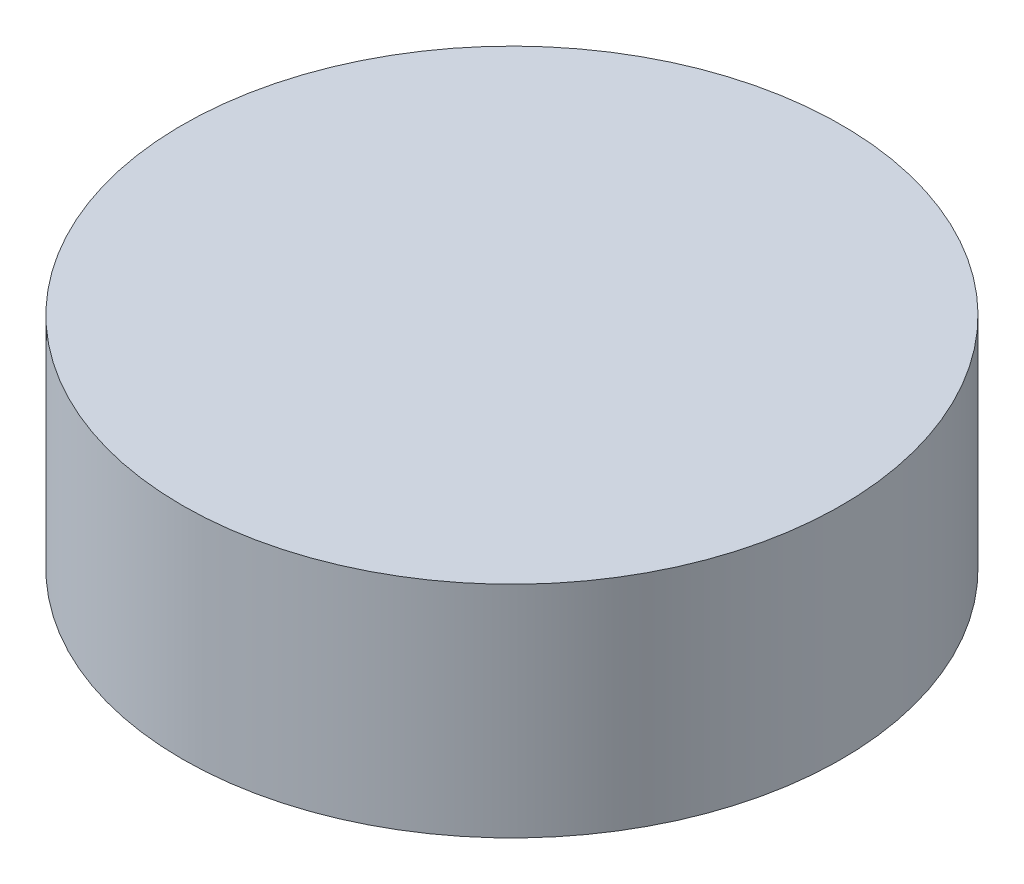
ISO-10303-21;
HEADER;
FILE_DESCRIPTION(('STEP AP214'),'2;1');
FILE_NAME('part.step','',(''),(''),'','','');
FILE_SCHEMA(('AUTOMOTIVE_DESIGN { 1 0 10303 214 1 1 1 1 }'));
ENDSEC;
DATA;
#1=APPLICATION_CONTEXT('core data for automotive mechanical design processes');
#2=APPLICATION_PROTOCOL_DEFINITION('international standard','automotive_design',2000,#1);
#3=PRODUCT_CONTEXT('',#1,'mechanical');
#4=PRODUCT('Part','Part','',(#3));
#5=PRODUCT_RELATED_PRODUCT_CATEGORY('part','',(#4));
#6=PRODUCT_DEFINITION_FORMATION('','',#4);
#7=PRODUCT_DEFINITION_CONTEXT('part definition',#1,'design');
#8=PRODUCT_DEFINITION('design','',#6,#7);
#9=PRODUCT_DEFINITION_SHAPE('','',#8);
#10=(LENGTH_UNIT() NAMED_UNIT(*) SI_UNIT(.MILLI.,.METRE.));
#11=(NAMED_UNIT(*) PLANE_ANGLE_UNIT() SI_UNIT($,.RADIAN.));
#12=(NAMED_UNIT(*) SI_UNIT($,.STERADIAN.) SOLID_ANGLE_UNIT());
#13=UNCERTAINTY_MEASURE_WITH_UNIT(LENGTH_MEASURE(1.E-05),#10,'distance_accuracy_value','');
#14=(GEOMETRIC_REPRESENTATION_CONTEXT(3) GLOBAL_UNCERTAINTY_ASSIGNED_CONTEXT((#13)) GLOBAL_UNIT_ASSIGNED_CONTEXT((#10,
#11,#12)) REPRESENTATION_CONTEXT('',''));
#15=CARTESIAN_POINT('',(0.,0.,0.));
#16=DIRECTION('',(0.,0.,1.));
#17=DIRECTION('',(1.,0.,0.));
#18=AXIS2_PLACEMENT_3D('',#15,#16,#17);
#19=CARTESIAN_POINT('',(0.,1.,0.));
#20=DIRECTION('',(0.,-1.,0.));
#21=DIRECTION('',(0.,0.,-1.));
#22=AXIS2_PLACEMENT_3D('',#19,#20,#21);
#23=CYLINDRICAL_SURFACE('',#22,1.5);
#24=CARTESIAN_POINT('',(0.,1.,0.));
#25=DIRECTION('',(0.,1.,0.));
#26=DIRECTION('',(0.,0.,1.));
#27=AXIS2_PLACEMENT_3D('',#24,#25,#26);
#28=CIRCLE('',#27,1.5);
#29=CARTESIAN_POINT('',(0.,1.,1.5));
#30=VERTEX_POINT('',#29);
#31=EDGE_CURVE('E10',#30,#30,#28,.T.);
#32=ORIENTED_EDGE('',*,*,#31,.F.);
#33=EDGE_LOOP('',(#32));
#34=FACE_BOUND('',#33,.T.);
#35=CARTESIAN_POINT('',(0.,0.,0.));
#36=DIRECTION('',(0.,1.,0.));
#37=DIRECTION('',(0.,0.,1.));
#38=AXIS2_PLACEMENT_3D('',#35,#36,#37);
#39=CIRCLE('',#38,1.5);
#40=CARTESIAN_POINT('',(0.,0.,1.5));
#41=VERTEX_POINT('',#40);
#42=EDGE_CURVE('E35',#41,#41,#39,.T.);
#43=ORIENTED_EDGE('',*,*,#42,.T.);
#44=EDGE_LOOP('',(#43));
#45=FACE_BOUND('',#44,.T.);
#46=ADVANCED_FACE('F32',(#34,#45),#23,.T.);
#47=CARTESIAN_POINT('',(0.,1.,0.));
#48=DIRECTION('',(0.,1.,0.));
#49=DIRECTION('',(0.,0.,1.));
#50=AXIS2_PLACEMENT_3D('',#47,#48,#49);
#51=PLANE('',#50);
#52=ORIENTED_EDGE('',*,*,#31,.T.);
#53=EDGE_LOOP('',(#52));
#54=FACE_BOUND('',#53,.T.);
#55=ADVANCED_FACE('F47',(#54),#51,.T.);
#56=CARTESIAN_POINT('',(0.,0.,0.));
#57=DIRECTION('',(0.,1.,0.));
#58=DIRECTION('',(0.,0.,1.));
#59=AXIS2_PLACEMENT_3D('',#56,#57,#58);
#60=PLANE('',#59);
#61=ORIENTED_EDGE('',*,*,#42,.F.);
#62=EDGE_LOOP('',(#61));
#63=FACE_BOUND('',#62,.T.);
#64=ADVANCED_FACE('F45',(#63),#60,.F.);
#65=CLOSED_SHELL('',(#46,#55,#64));
#66=MANIFOLD_SOLID_BREP('B2',#65);
#67=ADVANCED_BREP_SHAPE_REPRESENTATION('',(#18,#66),#14);
#68=SHAPE_DEFINITION_REPRESENTATION(#9,#67);
ENDSEC;
END-ISO-10303-21;
